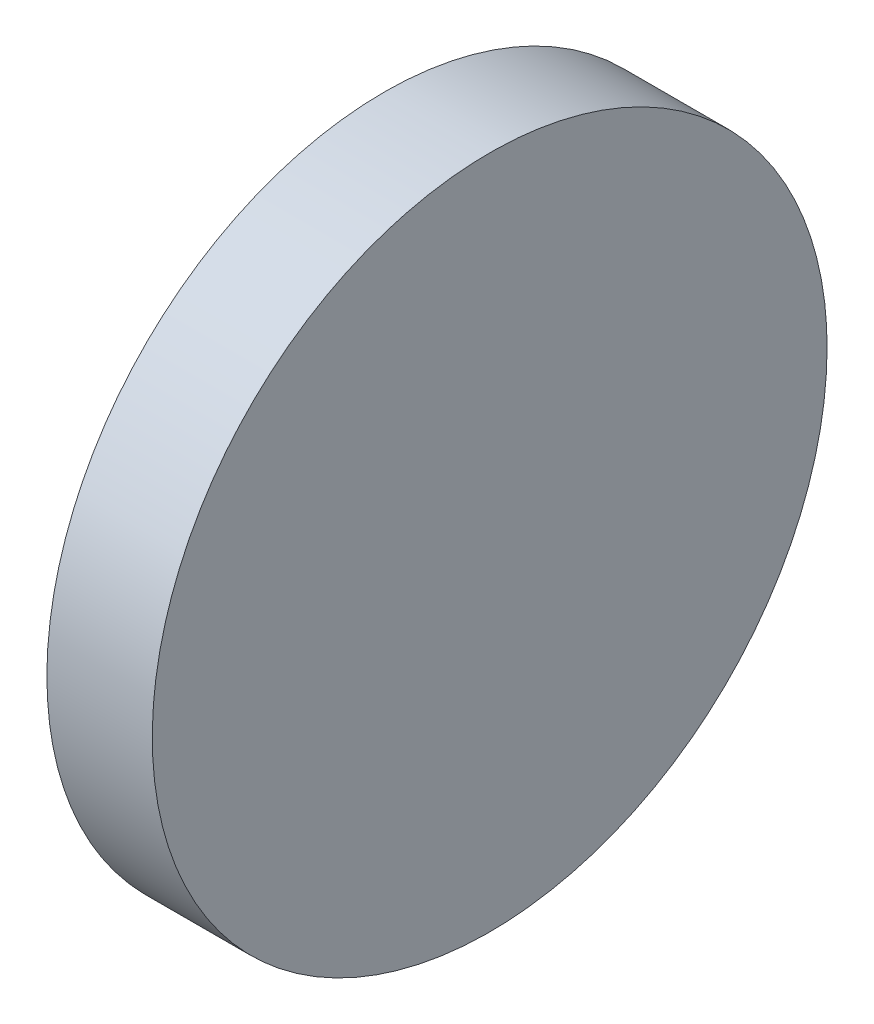
ISO-10303-21;
HEADER;
FILE_DESCRIPTION(('STEP AP214'),'2;1');
FILE_NAME('part.step','',(''),(''),'','','');
FILE_SCHEMA(('AUTOMOTIVE_DESIGN { 1 0 10303 214 1 1 1 1 }'));
ENDSEC;
DATA;
#1=APPLICATION_CONTEXT('core data for automotive mechanical design processes');
#2=APPLICATION_PROTOCOL_DEFINITION('international standard','automotive_design',2000,#1);
#3=PRODUCT_CONTEXT('',#1,'mechanical');
#4=PRODUCT('Part','Part','',(#3));
#5=PRODUCT_RELATED_PRODUCT_CATEGORY('part','',(#4));
#6=PRODUCT_DEFINITION_FORMATION('','',#4);
#7=PRODUCT_DEFINITION_CONTEXT('part definition',#1,'design');
#8=PRODUCT_DEFINITION('design','',#6,#7);
#9=PRODUCT_DEFINITION_SHAPE('','',#8);
#10=(LENGTH_UNIT() NAMED_UNIT(*) SI_UNIT(.MILLI.,.METRE.));
#11=(NAMED_UNIT(*) PLANE_ANGLE_UNIT() SI_UNIT($,.RADIAN.));
#12=(NAMED_UNIT(*) SI_UNIT($,.STERADIAN.) SOLID_ANGLE_UNIT());
#13=UNCERTAINTY_MEASURE_WITH_UNIT(LENGTH_MEASURE(1.E-05),#10,'distance_accuracy_value','');
#14=(GEOMETRIC_REPRESENTATION_CONTEXT(3) GLOBAL_UNCERTAINTY_ASSIGNED_CONTEXT((#13)) GLOBAL_UNIT_ASSIGNED_CONTEXT((#10,
#11,#12)) REPRESENTATION_CONTEXT('',''));
#15=CARTESIAN_POINT('',(0.,0.,0.));
#16=DIRECTION('',(0.,0.,1.));
#17=DIRECTION('',(1.,0.,0.));
#18=AXIS2_PLACEMENT_3D('',#15,#16,#17);
#19=CARTESIAN_POINT('',(1723.44341368852,190.588280016505,-62.7164754960861));
#20=CARTESIAN_POINT('',(1723.44341368852,188.737516544772,-62.7164754960861));
#21=CARTESIAN_POINT('',(1723.44341368852,185.035989601307,-62.3519069128598));
#22=CARTESIAN_POINT('',(1723.44341368852,179.697070593004,-60.732363537643));
#23=CARTESIAN_POINT('',(1723.44341368852,174.776694654986,-58.102367805708));
#24=CARTESIAN_POINT('',(1723.44341368852,170.463949075172,-54.5629889781144));
#25=CARTESIAN_POINT('',(1723.44341368852,166.924570247578,-50.2502433983002));
#26=CARTESIAN_POINT('',(1723.44341368852,164.294574515643,-45.329867460282));
#27=CARTESIAN_POINT('',(1723.44341368852,162.675031140426,-39.9909484519794));
#28=CARTESIAN_POINT('',(1723.44341368852,162.128178265587,-34.4386580367809));
#29=CARTESIAN_POINT('',(1723.44341368852,162.675031140426,-28.8863676215825));
#30=CARTESIAN_POINT('',(1723.44341368852,164.294574515643,-23.5474486132798));
#31=CARTESIAN_POINT('',(1723.44341368852,166.924570247578,-18.6270726752616));
#32=CARTESIAN_POINT('',(1723.44341368852,170.463949075172,-14.3143270954474));
#33=CARTESIAN_POINT('',(1723.44341368852,174.776694654986,-10.7749482678539));
#34=CARTESIAN_POINT('',(1723.44341368852,179.697070593004,-8.14495253591884));
#35=CARTESIAN_POINT('',(1723.44341368852,185.035989601307,-6.52540916070201));
#36=CARTESIAN_POINT('',(1723.44341368852,190.588280016505,-5.97855628586258));
#37=CARTESIAN_POINT('',(1723.44341368852,196.140570431704,-6.52540916070202));
#38=CARTESIAN_POINT('',(1723.44341368852,201.479489440006,-8.14495253591883));
#39=CARTESIAN_POINT('',(1723.44341368852,206.399865378024,-10.7749482678539));
#40=CARTESIAN_POINT('',(1723.44341368852,210.712610957839,-14.3143270954474));
#41=CARTESIAN_POINT('',(1723.44341368852,214.251989785432,-18.6270726752616));
#42=CARTESIAN_POINT('',(1723.44341368852,216.881985517367,-23.5474486132798));
#43=CARTESIAN_POINT('',(1723.44341368852,218.501528892584,-28.8863676215825));
#44=CARTESIAN_POINT('',(1723.44341368852,219.048381767423,-34.4386580367809));
#45=CARTESIAN_POINT('',(1723.44341368852,218.501528892584,-39.9909484519793));
#46=CARTESIAN_POINT('',(1723.44341368852,216.881985517367,-45.3298674602821));
#47=CARTESIAN_POINT('',(1723.44341368852,214.251989785432,-50.2502433983002));
#48=CARTESIAN_POINT('',(1723.44341368852,210.712610957839,-54.5629889781144));
#49=CARTESIAN_POINT('',(1723.44341368852,206.399865378024,-58.102367805708));
#50=CARTESIAN_POINT('',(1723.44341368852,201.479489440006,-60.732363537643));
#51=CARTESIAN_POINT('',(1723.44341368852,196.140570431703,-62.3519069128598));
#52=CARTESIAN_POINT('',(1723.44341368852,192.439043488238,-62.7164754960861));
#53=CARTESIAN_POINT('',(1723.44341368852,190.588280016505,-62.7164754960861));
#54=B_SPLINE_CURVE_WITH_KNOTS('',3,(#19,#20,#21,#22,#23,#24,#25,#26,#27,#28,#29,#30,#31,#32,#33,
#34,#35,#36,#37,#38,#39,#40,#41,#42,#43,#44,#45,#46,#47,#48,#49,#50,#51,#52,#53),.UNSPECIFIED.,
.T.,.F.,(4,1,1,1,1,1,1,1,1,1,1,1,1,1,1,1,1,1,1,1,1,1,1,1,1,1,1,1,1,1,1,1,4),(0.,
0.0312499999999999,0.0625,0.09375,0.125,0.15625,0.1875,0.21875,0.25,0.28125,0.3125,0.34375,
0.375,0.40625,0.4375,0.46875,0.5,0.53125,0.5625,0.59375,0.625,0.65625,0.6875,0.71875,0.75,
0.78125,0.8125,0.84375,0.875,0.90625,0.9375,0.96875,1.),.UNSPECIFIED.);
#55=DIRECTION('',(1.,0.,0.));
#56=VECTOR('',#55,1.);
#57=SURFACE_OF_LINEAR_EXTRUSION('',#54,#56);
#58=CARTESIAN_POINT('',(1723.44341368852,190.588280016505,-62.7164754960861));
#59=CARTESIAN_POINT('',(1723.44341368852,191.050973725528,-62.7164754001135));
#60=CARTESIAN_POINT('',(1723.44341368852,191.513664067124,-62.7050825918024));
#61=CARTESIAN_POINT('',(1723.44341368852,192.437933453871,-62.6596210688691));
#62=CARTESIAN_POINT('',(1723.44341368852,192.899512490361,-62.6255521781037));
#63=CARTESIAN_POINT('',(1723.44341368852,193.820447482561,-62.5348480120364));
#64=CARTESIAN_POINT('',(1723.44341368852,194.279803438271,-62.4782127367344));
#65=CARTESIAN_POINT('',(1723.44341368852,195.195183308172,-62.3424845678351));
#66=CARTESIAN_POINT('',(1723.44341368852,195.651207248216,-62.263391848688));
#67=CARTESIAN_POINT('',(1723.44341368852,196.558809812892,-62.0828584769059));
#68=CARTESIAN_POINT('',(1723.44341368852,197.010388437523,-61.981417824271));
#69=CARTESIAN_POINT('',(1723.44341368852,197.908030150492,-61.7565135660213));
#70=CARTESIAN_POINT('',(1723.44341368852,198.354093195959,-61.6330497893409));
#71=CARTESIAN_POINT('',(1723.44341368852,199.239636905868,-61.3644230421163));
#72=CARTESIAN_POINT('',(1723.44341368852,199.679117570309,-61.2192600715722));
#73=CARTESIAN_POINT('',(1723.44341368852,200.550429492769,-60.9075581095975));
#74=CARTESIAN_POINT('',(1723.44341368852,200.982260810179,-60.7410192842208));
#75=CARTESIAN_POINT('',(1723.44341368852,201.837203713072,-60.3868903388258));
#76=CARTESIAN_POINT('',(1723.44341368852,202.260315298554,-60.1993002188075));
#77=CARTESIAN_POINT('',(1723.44341368852,203.096832438733,-59.8035962206715));
#78=CARTESIAN_POINT('',(1723.44341368852,203.51023791801,-59.5954821831388));
#79=CARTESIAN_POINT('',(1723.44341368852,204.326359673833,-59.1592560163631));
#80=CARTESIAN_POINT('',(1723.44341368852,204.72907595038,-58.93114388712));
#81=CARTESIAN_POINT('',(1723.44341368852,205.522835822806,-58.4554466673194));
#82=CARTESIAN_POINT('',(1723.44341368852,205.913879509332,-58.2078617280384));
#83=CARTESIAN_POINT('',(1723.44341368852,206.683307793982,-57.6937461848247));
#84=CARTESIAN_POINT('',(1723.44341368852,207.061692392106,-57.427215580892));
#85=CARTESIAN_POINT('',(1723.44341368852,207.804938069606,-56.8759185258671));
#86=CARTESIAN_POINT('',(1723.44341368852,208.169799043911,-56.591151933137));
#87=CARTESIAN_POINT('',(1723.44341368852,208.885135745684,-56.0040902736904));
#88=CARTESIAN_POINT('',(1723.44341368852,209.235611473153,-55.7017952069741));
#89=CARTESIAN_POINT('',(1723.44341368852,209.921315548411,-55.0803835067495));
#90=CARTESIAN_POINT('',(1723.44341368852,210.25654401462,-54.7612670039265));
#91=CARTESIAN_POINT('',(1723.44341368852,210.910888983651,-54.1069220348954));
#92=CARTESIAN_POINT('',(1723.44341368852,211.230005486474,-53.7716935686873));
#93=CARTESIAN_POINT('',(1723.44341368852,211.851417186698,-53.0859894934286));
#94=CARTESIAN_POINT('',(1723.44341368852,212.153712253415,-52.73551376596));
#95=CARTESIAN_POINT('',(1723.44341368852,212.740773912861,-52.0201770641869));
#96=CARTESIAN_POINT('',(1723.44341368852,213.025540505591,-51.6553160898823));
#97=CARTESIAN_POINT('',(1723.44341368852,213.576837560616,-50.9120704123817));
#98=CARTESIAN_POINT('',(1723.44341368852,213.843368164549,-50.5336858142576));
#99=CARTESIAN_POINT('',(1723.44341368852,214.357483707762,-49.7642575296081));
#100=CARTESIAN_POINT('',(1723.44341368852,214.605068647044,-49.3732138430827));
#101=CARTESIAN_POINT('',(1723.44341368852,215.080765866844,-48.579453970655));
#102=CARTESIAN_POINT('',(1723.44341368852,215.308877996087,-48.1767376941056));
#103=CARTESIAN_POINT('',(1723.44341368852,215.745104162863,-47.3606159382896));
#104=CARTESIAN_POINT('',(1723.44341368852,215.953218200395,-46.9472104590229));
#105=CARTESIAN_POINT('',(1723.44341368852,216.348922198532,-46.1106933188156));
#106=CARTESIAN_POINT('',(1723.44341368852,216.536512318552,-45.6875817332959));
#107=CARTESIAN_POINT('',(1723.44341368852,216.890641263942,-44.8326388305067));
#108=CARTESIAN_POINT('',(1723.44341368852,217.057180089312,-44.4008075132372));
#109=CARTESIAN_POINT('',(1723.44341368852,217.368882051306,-43.5294955903923));
#110=CARTESIAN_POINT('',(1723.44341368852,217.514045021876,-43.0900149254241));
#111=CARTESIAN_POINT('',(1723.44341368852,217.782671769029,-42.2044712169548));
#112=CARTESIAN_POINT('',(1723.44341368852,217.906135545613,-41.7584081734538));
#113=CARTESIAN_POINT('',(1723.44341368852,218.131039804128,-40.8607664551138));
#114=CARTESIAN_POINT('',(1723.44341368852,218.232480457125,-40.4091878231462));
#115=CARTESIAN_POINT('',(1723.44341368852,218.413013827917,-39.501585278514));
#116=CARTESIAN_POINT('',(1723.44341368852,218.492106545713,-39.0455613658494));
#117=CARTESIAN_POINT('',(1723.44341368852,218.627834718305,-38.1301814211448));
#118=CARTESIAN_POINT('',(1723.44341368852,218.684469998651,-37.6708253632488));
#119=CARTESIAN_POINT('',(1723.44341368852,218.775174150937,-36.7498906502242));
#120=CARTESIAN_POINT('',(1723.44341368852,218.809243022877,-36.2883119950955));
#121=CARTESIAN_POINT('',(1723.44341368852,218.854704597242,-35.3640415664553));
#122=CARTESIAN_POINT('',(1723.44341368852,218.86609747581,-34.9013498016181));
#123=CARTESIAN_POINT('',(1723.44341368852,218.86609747581,-33.9759662719438));
#124=CARTESIAN_POINT('',(1723.44341368852,218.854704597242,-33.5132745071066));
#125=CARTESIAN_POINT('',(1723.44341368852,218.809243022877,-32.5890040784664));
#126=CARTESIAN_POINT('',(1723.44341368852,218.775174150937,-32.1274254233377));
#127=CARTESIAN_POINT('',(1723.44341368852,218.684469998651,-31.206490710313));
#128=CARTESIAN_POINT('',(1723.44341368852,218.627834718305,-30.7471346524171));
#129=CARTESIAN_POINT('',(1723.44341368852,218.492106545713,-29.8317547077125));
#130=CARTESIAN_POINT('',(1723.44341368852,218.413013827917,-29.3757307950479));
#131=CARTESIAN_POINT('',(1723.44341368852,218.232480457125,-28.4681282504157));
#132=CARTESIAN_POINT('',(1723.44341368852,218.131039804128,-28.0165496184481));
#133=CARTESIAN_POINT('',(1723.44341368852,217.906135545613,-27.1189079001081));
#134=CARTESIAN_POINT('',(1723.44341368852,217.782671769029,-26.672844856607));
#135=CARTESIAN_POINT('',(1723.44341368852,217.514045021876,-25.7873011481378));
#136=CARTESIAN_POINT('',(1723.44341368852,217.368882051306,-25.3478204831695));
#137=CARTESIAN_POINT('',(1723.44341368852,217.057180089312,-24.4765085603246));
#138=CARTESIAN_POINT('',(1723.44341368852,216.890641263942,-24.0446772430551));
#139=CARTESIAN_POINT('',(1723.44341368852,216.536512318552,-23.189734340266));
#140=CARTESIAN_POINT('',(1723.44341368852,216.348922198532,-22.7666227547462));
#141=CARTESIAN_POINT('',(1723.44341368852,215.953218200395,-21.9301056145389));
#142=CARTESIAN_POINT('',(1723.44341368852,215.745104162863,-21.5167001352722));
#143=CARTESIAN_POINT('',(1723.44341368852,215.308877996087,-20.7005783794562));
#144=CARTESIAN_POINT('',(1723.44341368852,215.080765866844,-20.2978621029069));
#145=CARTESIAN_POINT('',(1723.44341368852,214.605068647043,-19.5041022304792));
#146=CARTESIAN_POINT('',(1723.44341368852,214.357483707762,-19.1130585439537));
#147=CARTESIAN_POINT('',(1723.44341368852,213.843368164549,-18.3436302593042));
#148=CARTESIAN_POINT('',(1723.44341368852,213.576837560616,-17.9652456611802));
#149=CARTESIAN_POINT('',(1723.44341368852,213.025540505591,-17.2219999836795));
#150=CARTESIAN_POINT('',(1723.44341368852,212.740773912861,-16.8571390093749));
#151=CARTESIAN_POINT('',(1723.44341368852,212.153712253415,-16.1418023076018));
#152=CARTESIAN_POINT('',(1723.44341368852,211.851417186698,-15.7913265801333));
#153=CARTESIAN_POINT('',(1723.44341368852,211.230005486474,-15.1056225048745));
#154=CARTESIAN_POINT('',(1723.44341368852,210.910888983651,-14.7703940386664));
#155=CARTESIAN_POINT('',(1723.44341368852,210.25654401462,-14.1160490696353));
#156=CARTESIAN_POINT('',(1723.44341368852,209.921315548411,-13.7969325668124));
#157=CARTESIAN_POINT('',(1723.44341368852,209.235611473153,-13.1755208665878));
#158=CARTESIAN_POINT('',(1723.44341368852,208.885135745684,-12.8732257998714));
#159=CARTESIAN_POINT('',(1723.44341368852,208.169799043911,-12.2861641404249));
#160=CARTESIAN_POINT('',(1723.44341368852,207.804938069606,-12.0013975476947));
#161=CARTESIAN_POINT('',(1723.44341368852,207.061692392106,-11.4501004926698));
#162=CARTESIAN_POINT('',(1723.44341368852,206.683307793982,-11.1835698887371));
#163=CARTESIAN_POINT('',(1723.44341368852,205.913879509332,-10.6694543455234));
#164=CARTESIAN_POINT('',(1723.44341368852,205.522835822807,-10.4218694062424));
#165=CARTESIAN_POINT('',(1723.44341368852,204.729075950379,-9.94617218644181));
#166=CARTESIAN_POINT('',(1723.44341368852,204.32635967383,-9.71806005719854));
#167=CARTESIAN_POINT('',(1723.44341368852,203.510237918014,-9.28183389042317));
#168=CARTESIAN_POINT('',(1723.44341368852,203.096832438747,-9.07371985289106));
#169=CARTESIAN_POINT('',(1723.44341368852,202.26031529854,-8.67801585475368));
#170=CARTESIAN_POINT('',(1723.44341368852,201.83720371302,-8.49042573473348));
#171=CARTESIAN_POINT('',(1723.44341368852,200.982260810231,-8.13629678934358));
#172=CARTESIAN_POINT('',(1723.44341368852,200.550429492961,-7.96975796397388));
#173=CARTESIAN_POINT('',(1723.44341368852,199.679117570116,-7.65805600198009));
#174=CARTESIAN_POINT('',(1723.44341368852,199.239636905148,-7.51289303141));
#175=CARTESIAN_POINT('',(1723.44341368852,198.354093196679,-7.2442662842565));
#176=CARTESIAN_POINT('',(1723.44341368852,197.908030153178,-7.12080250767309));
#177=CARTESIAN_POINT('',(1723.44341368852,197.010388434838,-6.8958982491583));
#178=CARTESIAN_POINT('',(1723.44341368852,196.55880980287,-6.79445759616121));
#179=CARTESIAN_POINT('',(1723.44341368852,195.651207258238,-6.61392422536862));
#180=CARTESIAN_POINT('',(1723.44341368852,195.195183345574,-6.53483150757312));
#181=CARTESIAN_POINT('',(1723.44341368852,194.279803400869,-6.39910333498111));
#182=CARTESIAN_POINT('',(1723.44341368852,193.820447342973,-6.34246805463487));
#183=CARTESIAN_POINT('',(1723.44341368852,192.899512629948,-6.25176390234874));
#184=CARTESIAN_POINT('',(1723.44341368852,192.43793397482,-6.21769503040885));
#185=CARTESIAN_POINT('',(1723.44341368852,191.513663546179,-6.1722334560436));
#186=CARTESIAN_POINT('',(1723.44341368852,191.050971781342,-6.16084057747573));
#187=CARTESIAN_POINT('',(1723.44341368852,190.125588251668,-6.16084057747572));
#188=CARTESIAN_POINT('',(1723.44341368852,189.662896486831,-6.1722334560436));
#189=CARTESIAN_POINT('',(1723.44341368852,188.73862605819,-6.21769503040885));
#190=CARTESIAN_POINT('',(1723.44341368852,188.277047403062,-6.25176390234873));
#191=CARTESIAN_POINT('',(1723.44341368852,187.356112690037,-6.34246805463486));
#192=CARTESIAN_POINT('',(1723.44341368852,186.896756632141,-6.3991033349811));
#193=CARTESIAN_POINT('',(1723.44341368852,185.981376687437,-6.53483150757311));
#194=CARTESIAN_POINT('',(1723.44341368852,185.525352774772,-6.61392422536861));
#195=CARTESIAN_POINT('',(1723.44341368852,184.61775023014,-6.7944575961612));
#196=CARTESIAN_POINT('',(1723.44341368852,184.166171598172,-6.89589824915829));
#197=CARTESIAN_POINT('',(1723.44341368852,183.268529879832,-7.12080250767309));
#198=CARTESIAN_POINT('',(1723.44341368852,182.822466836331,-7.24426628425649));
#199=CARTESIAN_POINT('',(1723.44341368852,181.936923127862,-7.51289303140999));
#200=CARTESIAN_POINT('',(1723.44341368852,181.497442462894,-7.65805600198008));
#201=CARTESIAN_POINT('',(1723.44341368852,180.626130540049,-7.96975796397388));
#202=CARTESIAN_POINT('',(1723.44341368852,180.194299222779,-8.13629678934358));
#203=CARTESIAN_POINT('',(1723.44341368852,179.33935631999,-8.49042573473348));
#204=CARTESIAN_POINT('',(1723.44341368852,178.91624473447,-8.67801585475368));
#205=CARTESIAN_POINT('',(1723.44341368852,178.079727594263,-9.07371985289106));
#206=CARTESIAN_POINT('',(1723.44341368852,177.666322114996,-9.28183389042318));
#207=CARTESIAN_POINT('',(1723.44341368852,176.85020035918,-9.71806005719855));
#208=CARTESIAN_POINT('',(1723.44341368852,176.447484082631,-9.94617218644181));
#209=CARTESIAN_POINT('',(1723.44341368852,175.653724210203,-10.4218694062424));
#210=CARTESIAN_POINT('',(1723.44341368852,175.262680523678,-10.6694543455234));
#211=CARTESIAN_POINT('',(1723.44341368852,174.493252239028,-11.1835698887371));
#212=CARTESIAN_POINT('',(1723.44341368852,174.114867640904,-11.4501004926698));
#213=CARTESIAN_POINT('',(1723.44341368852,173.371621963404,-12.0013975476947));
#214=CARTESIAN_POINT('',(1723.44341368852,173.006760989099,-12.2861641404249));
#215=CARTESIAN_POINT('',(1723.44341368852,172.291424287326,-12.8732257998714));
#216=CARTESIAN_POINT('',(1723.44341368852,171.940948559857,-13.1755208665878));
#217=CARTESIAN_POINT('',(1723.44341368852,171.255244484599,-13.7969325668124));
#218=CARTESIAN_POINT('',(1723.44341368852,170.920016018391,-14.1160490696353));
#219=CARTESIAN_POINT('',(1723.44341368852,170.265671049359,-14.7703940386664));
#220=CARTESIAN_POINT('',(1723.44341368852,169.946554546537,-15.1056225048745));
#221=CARTESIAN_POINT('',(1723.44341368852,169.325142846312,-15.7913265801333));
#222=CARTESIAN_POINT('',(1723.44341368852,169.022847779596,-16.1418023076018));
#223=CARTESIAN_POINT('',(1723.44341368852,168.435786120149,-16.8571390093749));
#224=CARTESIAN_POINT('',(1723.44341368852,168.151019527419,-17.2219999836795));
#225=CARTESIAN_POINT('',(1723.44341368852,167.599722472394,-17.9652456611802));
#226=CARTESIAN_POINT('',(1723.44341368852,167.333191868461,-18.3436302593042));
#227=CARTESIAN_POINT('',(1723.44341368852,166.819076325248,-19.1130585439537));
#228=CARTESIAN_POINT('',(1723.44341368852,166.571491385967,-19.5041022304792));
#229=CARTESIAN_POINT('',(1723.44341368852,166.095794166166,-20.2978621029069));
#230=CARTESIAN_POINT('',(1723.44341368852,165.867682036923,-20.7005783794562));
#231=CARTESIAN_POINT('',(1723.44341368852,165.431455870147,-21.5167001352722));
#232=CARTESIAN_POINT('',(1723.44341368852,165.223341832615,-21.9301056145389));
#233=CARTESIAN_POINT('',(1723.44341368852,164.827637834478,-22.7666227547462));
#234=CARTESIAN_POINT('',(1723.44341368852,164.640047714458,-23.1897343402659));
#235=CARTESIAN_POINT('',(1723.44341368852,164.285918769068,-24.0446772430551));
#236=CARTESIAN_POINT('',(1723.44341368852,164.119379943698,-24.4765085603246));
#237=CARTESIAN_POINT('',(1723.44341368852,163.807677981704,-25.3478204831695));
#238=CARTESIAN_POINT('',(1723.44341368852,163.662515011134,-25.7873011481378));
#239=CARTESIAN_POINT('',(1723.44341368852,163.393888263981,-26.672844856607));
#240=CARTESIAN_POINT('',(1723.44341368852,163.270424487397,-27.118907900108));
#241=CARTESIAN_POINT('',(1723.44341368852,163.045520228882,-28.0165496184481));
#242=CARTESIAN_POINT('',(1723.44341368852,162.944079575885,-28.4681282504157));
#243=CARTESIAN_POINT('',(1723.44341368852,162.763546205093,-29.3757307950479));
#244=CARTESIAN_POINT('',(1723.44341368852,162.684453487297,-29.8317547077124));
#245=CARTESIAN_POINT('',(1723.44341368852,162.548725314705,-30.747134652417));
#246=CARTESIAN_POINT('',(1723.44341368852,162.492090034359,-31.206490710313));
#247=CARTESIAN_POINT('',(1723.44341368852,162.401385882073,-32.1274254233377));
#248=CARTESIAN_POINT('',(1723.44341368852,162.367317010133,-32.5890040784664));
#249=CARTESIAN_POINT('',(1723.44341368852,162.321855435768,-33.5132745071066));
#250=CARTESIAN_POINT('',(1723.44341368852,162.3104625572,-33.9759662719437));
#251=CARTESIAN_POINT('',(1723.44341368852,162.3104625572,-34.9013498016181));
#252=CARTESIAN_POINT('',(1723.44341368852,162.321855435768,-35.3640415664553));
#253=CARTESIAN_POINT('',(1723.44341368852,162.367317010133,-36.2883119950955));
#254=CARTESIAN_POINT('',(1723.44341368852,162.401385882073,-36.7498906502241));
#255=CARTESIAN_POINT('',(1723.44341368852,162.492090034359,-37.6708253632488));
#256=CARTESIAN_POINT('',(1723.44341368852,162.548725314705,-38.1301814211448));
#257=CARTESIAN_POINT('',(1723.44341368852,162.684453487297,-39.0455613658494));
#258=CARTESIAN_POINT('',(1723.44341368852,162.763546205093,-39.501585278514));
#259=CARTESIAN_POINT('',(1723.44341368852,162.944079575885,-40.4091878231462));
#260=CARTESIAN_POINT('',(1723.44341368852,163.045520228882,-40.8607664551137));
#261=CARTESIAN_POINT('',(1723.44341368852,163.270424487397,-41.7584081734538));
#262=CARTESIAN_POINT('',(1723.44341368852,163.393888263981,-42.2044712169548));
#263=CARTESIAN_POINT('',(1723.44341368852,163.662515011134,-43.0900149254241));
#264=CARTESIAN_POINT('',(1723.44341368852,163.807677981704,-43.5294955903923));
#265=CARTESIAN_POINT('',(1723.44341368852,164.119379943698,-44.4008075132372));
#266=CARTESIAN_POINT('',(1723.44341368852,164.285918769068,-44.8326388305067));
#267=CARTESIAN_POINT('',(1723.44341368852,164.640047714458,-45.6875817332959));
#268=CARTESIAN_POINT('',(1723.44341368852,164.827637834478,-46.1106933188156));
#269=CARTESIAN_POINT('',(1723.44341368852,165.223341832615,-46.9472104590229));
#270=CARTESIAN_POINT('',(1723.44341368852,165.431455870147,-47.3606159382896));
#271=CARTESIAN_POINT('',(1723.44341368852,165.867682036923,-48.1767376941056));
#272=CARTESIAN_POINT('',(1723.44341368852,166.095794166166,-48.579453970655));
#273=CARTESIAN_POINT('',(1723.44341368852,166.571491385967,-49.3732138430827));
#274=CARTESIAN_POINT('',(1723.44341368852,166.819076325248,-49.7642575296081));
#275=CARTESIAN_POINT('',(1723.44341368852,167.333191868461,-50.5336858142576));
#276=CARTESIAN_POINT('',(1723.44341368852,167.599722472394,-50.9120704123817));
#277=CARTESIAN_POINT('',(1723.44341368852,168.151019527419,-51.6553160898823));
#278=CARTESIAN_POINT('',(1723.44341368852,168.435786120149,-52.0201770641869));
#279=CARTESIAN_POINT('',(1723.44341368852,169.022847779596,-52.73551376596));
#280=CARTESIAN_POINT('',(1723.44341368852,169.325142846312,-53.0859894934286));
#281=CARTESIAN_POINT('',(1723.44341368852,169.946554546536,-53.7716935686873));
#282=CARTESIAN_POINT('',(1723.44341368852,170.265671049359,-54.1069220348954));
#283=CARTESIAN_POINT('',(1723.44341368852,170.920016018391,-54.7612670039265));
#284=CARTESIAN_POINT('',(1723.44341368852,171.255244484599,-55.0803835067495));
#285=CARTESIAN_POINT('',(1723.44341368852,171.940948559857,-55.7017952069741));
#286=CARTESIAN_POINT('',(1723.44341368852,172.291424287326,-56.0040902736905));
#287=CARTESIAN_POINT('',(1723.44341368852,173.006760989099,-56.591151933137));
#288=CARTESIAN_POINT('',(1723.44341368852,173.371621963404,-56.8759185258671));
#289=CARTESIAN_POINT('',(1723.44341368852,174.114867640904,-57.427215580892));
#290=CARTESIAN_POINT('',(1723.44341368852,174.493252239028,-57.6937461848247));
#291=CARTESIAN_POINT('',(1723.44341368852,175.262680523678,-58.2078617280384));
#292=CARTESIAN_POINT('',(1723.44341368852,175.653724210204,-58.4554466673194));
#293=CARTESIAN_POINT('',(1723.44341368852,176.44748408263,-58.93114388712));
#294=CARTESIAN_POINT('',(1723.44341368852,176.850200359177,-59.1592560163631));
#295=CARTESIAN_POINT('',(1723.44341368852,177.666322115,-59.5954821831388));
#296=CARTESIAN_POINT('',(1723.44341368852,178.079727594277,-59.8035962206715));
#297=CARTESIAN_POINT('',(1723.44341368852,178.916244734456,-60.1993002188075));
#298=CARTESIAN_POINT('',(1723.44341368852,179.339356319938,-60.3868903388258));
#299=CARTESIAN_POINT('',(1723.44341368852,180.194299222831,-60.7410192842208));
#300=CARTESIAN_POINT('',(1723.44341368852,180.626130540241,-60.9075581095975));
#301=CARTESIAN_POINT('',(1723.44341368852,181.497442462701,-61.2192600715722));
#302=CARTESIAN_POINT('',(1723.44341368852,181.936923127142,-61.3644230421163));
#303=CARTESIAN_POINT('',(1723.44341368852,182.822466837051,-61.6330497893409));
#304=CARTESIAN_POINT('',(1723.44341368852,183.268529882518,-61.7565135660213));
#305=CARTESIAN_POINT('',(1723.44341368852,184.166171595487,-61.981417824271));
#306=CARTESIAN_POINT('',(1723.44341368852,184.617750220118,-62.0828584769059));
#307=CARTESIAN_POINT('',(1723.44341368852,185.525352784794,-62.263391848688));
#308=CARTESIAN_POINT('',(1723.44341368852,185.981376724839,-62.342484567835));
#309=CARTESIAN_POINT('',(1723.44341368852,186.896756594739,-62.4782127367344));
#310=CARTESIAN_POINT('',(1723.44341368852,187.356112550449,-62.5348480120364));
#311=CARTESIAN_POINT('',(1723.44341368852,188.27704754265,-62.6255521781037));
#312=CARTESIAN_POINT('',(1723.44341368852,188.738626579139,-62.6596210688691));
#313=CARTESIAN_POINT('',(1723.44341368852,189.662895965886,-62.7050825918024));
#314=CARTESIAN_POINT('',(1723.44341368852,190.125586307483,-62.7164754001135));
#315=CARTESIAN_POINT('',(1723.44341368852,190.588280016505,-62.7164754960861));
#316=B_SPLINE_CURVE_WITH_KNOTS('',3,(#58,#59,#60,#61,#62,#63,#64,#65,#66,#67,#68,#69,#70,#71,
#72,#73,#74,#75,#76,#77,#78,#79,#80,#81,#82,#83,#84,#85,#86,#87,#88,#89,#90,#91,#92,#93,#94,#95,
#96,#97,#98,#99,#100,#101,#102,#103,#104,#105,#106,#107,#108,#109,#110,#111,#112,#113,#114,#115,
#116,#117,#118,#119,#120,#121,#122,#123,#124,#125,#126,#127,#128,#129,#130,#131,#132,#133,#134,
#135,#136,#137,#138,#139,#140,#141,#142,#143,#144,#145,#146,#147,#148,#149,#150,#151,#152,#153,
#154,#155,#156,#157,#158,#159,#160,#161,#162,#163,#164,#165,#166,#167,#168,#169,#170,#171,#172,
#173,#174,#175,#176,#177,#178,#179,#180,#181,#182,#183,#184,#185,#186,#187,#188,#189,#190,#191,
#192,#193,#194,#195,#196,#197,#198,#199,#200,#201,#202,#203,#204,#205,#206,#207,#208,#209,#210,
#211,#212,#213,#214,#215,#216,#217,#218,#219,#220,#221,#222,#223,#224,#225,#226,#227,#228,#229,
#230,#231,#232,#233,#234,#235,#236,#237,#238,#239,#240,#241,#242,#243,#244,#245,#246,#247,#248,
#249,#250,#251,#252,#253,#254,#255,#256,#257,#258,#259,#260,#261,#262,#263,#264,#265,#266,#267,
#268,#269,#270,#271,#272,#273,#274,#275,#276,#277,#278,#279,#280,#281,#282,#283,#284,#285,#286,
#287,#288,#289,#290,#291,#292,#293,#294,#295,#296,#297,#298,#299,#300,#301,#302,#303,#304,#305,
#306,#307,#308,#309,#310,#311,#312,#313,#314,#315),.UNSPECIFIED.,.F.,.F.,(4,2,2,2,2,2,2,2,2,2,2,
2,2,2,2,2,2,2,2,2,2,2,2,2,2,2,2,2,2,2,2,2,2,2,2,2,2,2,2,2,2,2,2,2,2,2,2,2,2,2,2,2,2,2,2,2,2,2,2,
2,2,2,2,2,2,2,2,2,2,2,2,2,2,2,2,2,2,2,2,2,2,2,2,2,2,2,2,2,2,2,2,2,2,2,2,2,2,2,2,2,2,2,2,2,2,2,2,
2,2,2,2,2,2,2,2,2,2,2,2,2,2,2,2,2,2,2,2,2,4),(0.,1.3879364908246,2.77588376298434,
4.1638310351441,5.55176752596871,6.93970401679332,8.32765128895309,9.71559856111286,
11.1035350519375,12.4914715427621,13.8794188149218,15.2673660870816,16.6553025779062,
18.0432390687309,19.4311863408906,20.8191336130503,22.207070103875,23.5950065946996,
24.9829538668593,26.3709011390191,27.7588376298437,29.1467741206684,30.5347213928281,
31.9226686649878,33.3106051558125,34.6985416466371,36.0864889187968,37.4744361909566,
38.8623726817812,40.2503091726058,41.6382564447656,43.0262037169253,44.4141402077499,
45.8020766985746,47.1900239707343,48.5779712428941,49.9659077337187,51.3538442245433,
52.7417914967031,54.1297387688628,55.5176752596874,56.9056117505121,58.2935590226718,
59.6815062948316,61.0694427856562,62.4573792764808,63.8453265486406,65.2332738208003,
66.6212103116249,68.0091468024495,69.3970940746093,70.785041346769,72.1729778375937,
73.5609143284183,74.948861600578,76.3368088727378,77.7247453635625,79.1126818543871,
80.5006291265468,81.8885763987065,83.2765128895312,84.6644493803558,86.0523966525155,
87.4403439246753,88.8282804154999,90.2162169063246,91.6041641784844,92.9921114506441,
94.3800479414687,95.7679844322934,97.1559317044531,98.5438789766128,99.9318154674375,
101.319751958262,102.707699230422,104.095646502582,105.483582993406,106.871519484231,
108.259466756391,109.64741402855,111.035350519375,112.4232870102,113.811234282359,
115.199181554519,116.587118045344,117.975054536168,119.363001808328,120.750949080488,
122.138885571312,123.526822062137,124.914769334297,126.302716606457,127.690653097281,
129.078589588106,130.466536860266,131.854484132425,133.24242062325,134.630357114075,
136.018304386234,137.406251658394,138.794188149219,140.182124640043,141.570071912203,
142.958019184363,144.345955675187,145.733892166012,147.121839438172,148.509786710332,
149.897723201156,151.285659691981,152.673606964141,154.0615542363,155.449490727125,
156.83742721795,158.225374490109,159.613321762269,161.001258253094,162.389194743918,
163.777142016078,165.165089288238,166.553025779062,167.940962269887,169.328909542047,
170.716856814207,172.104793305031,173.492729795856,174.880677068016,176.268624340175,
177.656560831),.UNSPECIFIED.);
#317=CARTESIAN_POINT('',(1723.44341368852,190.588280016505,-62.7164754960861));
#318=VERTEX_POINT('',#317);
#319=EDGE_CURVE('E9',#318,#318,#316,.F.);
#320=ORIENTED_EDGE('',*,*,#319,.F.);
#321=EDGE_LOOP('',(#320));
#322=FACE_BOUND('',#321,.T.);
#323=CARTESIAN_POINT('',(1732.27593370311,190.588280016505,-62.7164754960861));
#324=CARTESIAN_POINT('',(1732.27593370311,188.737516544772,-62.7164754960861));
#325=CARTESIAN_POINT('',(1732.27593370311,185.035989601307,-62.3519069128598));
#326=CARTESIAN_POINT('',(1732.27593370311,179.697070593004,-60.732363537643));
#327=CARTESIAN_POINT('',(1732.27593370311,174.776694654986,-58.102367805708));
#328=CARTESIAN_POINT('',(1732.27593370311,170.463949075172,-54.5629889781144));
#329=CARTESIAN_POINT('',(1732.27593370311,166.924570247578,-50.2502433983002));
#330=CARTESIAN_POINT('',(1732.27593370311,164.294574515643,-45.329867460282));
#331=CARTESIAN_POINT('',(1732.27593370311,162.675031140426,-39.9909484519794));
#332=CARTESIAN_POINT('',(1732.27593370311,162.128178265587,-34.4386580367809));
#333=CARTESIAN_POINT('',(1732.27593370311,162.675031140426,-28.8863676215825));
#334=CARTESIAN_POINT('',(1732.27593370311,164.294574515643,-23.5474486132798));
#335=CARTESIAN_POINT('',(1732.27593370311,166.924570247578,-18.6270726752616));
#336=CARTESIAN_POINT('',(1732.27593370311,170.463949075172,-14.3143270954474));
#337=CARTESIAN_POINT('',(1732.27593370311,174.776694654986,-10.7749482678539));
#338=CARTESIAN_POINT('',(1732.27593370311,179.697070593004,-8.14495253591884));
#339=CARTESIAN_POINT('',(1732.27593370311,185.035989601307,-6.52540916070201));
#340=CARTESIAN_POINT('',(1732.27593370311,190.588280016505,-5.97855628586258));
#341=CARTESIAN_POINT('',(1732.27593370311,196.140570431704,-6.52540916070202));
#342=CARTESIAN_POINT('',(1732.27593370311,201.479489440006,-8.14495253591883));
#343=CARTESIAN_POINT('',(1732.27593370311,206.399865378024,-10.7749482678539));
#344=CARTESIAN_POINT('',(1732.27593370311,210.712610957839,-14.3143270954474));
#345=CARTESIAN_POINT('',(1732.27593370311,214.251989785432,-18.6270726752616));
#346=CARTESIAN_POINT('',(1732.27593370311,216.881985517367,-23.5474486132798));
#347=CARTESIAN_POINT('',(1732.27593370311,218.501528892584,-28.8863676215825));
#348=CARTESIAN_POINT('',(1732.27593370311,219.048381767423,-34.4386580367809));
#349=CARTESIAN_POINT('',(1732.27593370311,218.501528892584,-39.9909484519793));
#350=CARTESIAN_POINT('',(1732.27593370311,216.881985517367,-45.3298674602821));
#351=CARTESIAN_POINT('',(1732.27593370311,214.251989785432,-50.2502433983002));
#352=CARTESIAN_POINT('',(1732.27593370311,210.712610957839,-54.5629889781144));
#353=CARTESIAN_POINT('',(1732.27593370311,206.399865378024,-58.102367805708));
#354=CARTESIAN_POINT('',(1732.27593370311,201.479489440006,-60.732363537643));
#355=CARTESIAN_POINT('',(1732.27593370311,196.140570431703,-62.3519069128598));
#356=CARTESIAN_POINT('',(1732.27593370311,192.439043488238,-62.7164754960861));
#357=CARTESIAN_POINT('',(1732.27593370311,190.588280016505,-62.7164754960861));
#358=B_SPLINE_CURVE_WITH_KNOTS('',3,(#323,#324,#325,#326,#327,#328,#329,#330,#331,#332,#333,
#334,#335,#336,#337,#338,#339,#340,#341,#342,#343,#344,#345,#346,#347,#348,#349,#350,#351,#352,
#353,#354,#355,#356,#357),.UNSPECIFIED.,.T.,.F.,(4,1,1,1,1,1,1,1,1,1,1,1,1,1,1,1,1,1,1,1,1,1,1,
1,1,1,1,1,1,1,1,1,4),(0.,0.0312499999999999,0.0625,0.09375,0.125,0.15625,0.1875,0.21875,0.25,
0.28125,0.3125,0.34375,0.375,0.40625,0.4375,0.46875,0.5,0.53125,0.5625,0.59375,0.625,0.65625,
0.6875,0.71875,0.75,0.78125,0.8125,0.84375,0.875,0.90625,0.9375,0.96875,1.),.UNSPECIFIED.);
#359=CARTESIAN_POINT('',(1732.27593370311,190.588280016505,-62.7164754960861));
#360=VERTEX_POINT('',#359);
#361=EDGE_CURVE('E24',#360,#360,#358,.T.);
#362=ORIENTED_EDGE('',*,*,#361,.T.);
#363=EDGE_LOOP('',(#362));
#364=FACE_BOUND('',#363,.T.);
#365=ADVANCED_FACE('F14',(#322,#364),#57,.F.);
#366=CARTESIAN_POINT('',(1723.44341368852,218.088280016505,-34.4386580367809));
#367=DIRECTION('',(1.,0.,0.));
#368=DIRECTION('',(0.,1.,0.));
#369=AXIS2_PLACEMENT_3D('',#366,#367,#368);
#370=PLANE('',#369);
#371=ORIENTED_EDGE('',*,*,#319,.T.);
#372=EDGE_LOOP('',(#371));
#373=FACE_BOUND('',#372,.T.);
#374=ADVANCED_FACE('F59',(#373),#370,.F.);
#375=CARTESIAN_POINT('',(1732.27593370311,218.088280016505,-34.4386580367809));
#376=DIRECTION('',(1.,0.,0.));
#377=DIRECTION('',(0.,1.,0.));
#378=AXIS2_PLACEMENT_3D('',#375,#376,#377);
#379=PLANE('',#378);
#380=ORIENTED_EDGE('',*,*,#361,.F.);
#381=EDGE_LOOP('',(#380));
#382=FACE_BOUND('',#381,.T.);
#383=ADVANCED_FACE('F67',(#382),#379,.T.);
#384=CLOSED_SHELL('',(#365,#374,#383));
#385=MANIFOLD_SOLID_BREP('B1',#384);
#386=ADVANCED_BREP_SHAPE_REPRESENTATION('',(#18,#385),#14);
#387=SHAPE_DEFINITION_REPRESENTATION(#9,#386);
ENDSEC;
END-ISO-10303-21;
